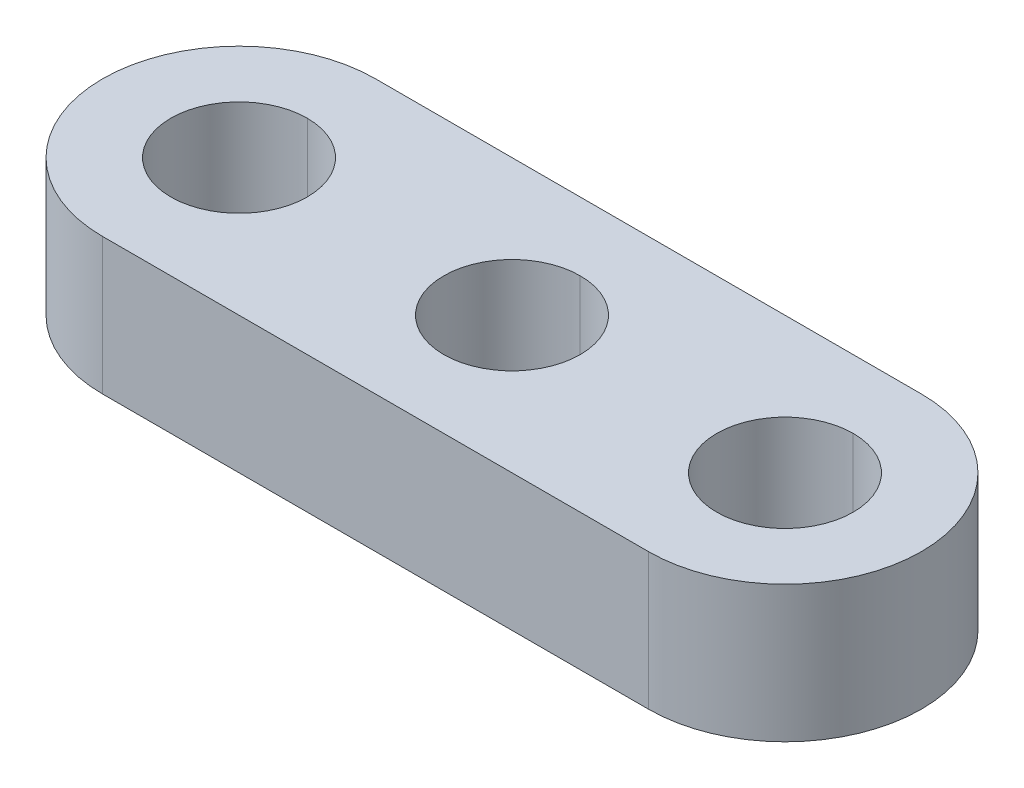
ISO-10303-21;
HEADER;
FILE_DESCRIPTION(('STEP AP214'),'2;1');
FILE_NAME('part.step','',(''),(''),'','','');
FILE_SCHEMA(('AUTOMOTIVE_DESIGN { 1 0 10303 214 1 1 1 1 }'));
ENDSEC;
DATA;
#1=APPLICATION_CONTEXT('core data for automotive mechanical design processes');
#2=APPLICATION_PROTOCOL_DEFINITION('international standard','automotive_design',2000,#1);
#3=PRODUCT_CONTEXT('',#1,'mechanical');
#4=PRODUCT('Part','Part','',(#3));
#5=PRODUCT_RELATED_PRODUCT_CATEGORY('part','',(#4));
#6=PRODUCT_DEFINITION_FORMATION('','',#4);
#7=PRODUCT_DEFINITION_CONTEXT('part definition',#1,'design');
#8=PRODUCT_DEFINITION('design','',#6,#7);
#9=PRODUCT_DEFINITION_SHAPE('','',#8);
#10=(LENGTH_UNIT() NAMED_UNIT(*) SI_UNIT(.MILLI.,.METRE.));
#11=(NAMED_UNIT(*) PLANE_ANGLE_UNIT() SI_UNIT($,.RADIAN.));
#12=(NAMED_UNIT(*) SI_UNIT($,.STERADIAN.) SOLID_ANGLE_UNIT());
#13=UNCERTAINTY_MEASURE_WITH_UNIT(LENGTH_MEASURE(1.E-05),#10,'distance_accuracy_value','');
#14=(GEOMETRIC_REPRESENTATION_CONTEXT(3) GLOBAL_UNCERTAINTY_ASSIGNED_CONTEXT((#13)) GLOBAL_UNIT_ASSIGNED_CONTEXT((#10,
#11,#12)) REPRESENTATION_CONTEXT('',''));
#15=CARTESIAN_POINT('',(0.,0.,0.));
#16=DIRECTION('',(0.,0.,1.));
#17=DIRECTION('',(1.,0.,0.));
#18=AXIS2_PLACEMENT_3D('',#15,#16,#17);
#19=CARTESIAN_POINT('',(8.,4.,0.));
#20=DIRECTION('',(0.,1.,0.));
#21=DIRECTION('',(0.,0.,1.));
#22=AXIS2_PLACEMENT_3D('',#19,#20,#21);
#23=CYLINDRICAL_SURFACE('',#22,2.);
#24=DIRECTION('',(0.,1.,0.));
#25=VECTOR('',#24,1.);
#26=CARTESIAN_POINT('',(8.,4.,-2.));
#27=LINE('',#26,#25);
#28=CARTESIAN_POINT('',(8.,0.,-2.));
#29=VERTEX_POINT('',#28);
#30=CARTESIAN_POINT('',(8.,4.,-2.));
#31=VERTEX_POINT('',#30);
#32=EDGE_CURVE('E172',#29,#31,#27,.T.);
#33=ORIENTED_EDGE('',*,*,#32,.F.);
#34=CARTESIAN_POINT('',(8.,0.,0.));
#35=DIRECTION('',(0.,1.,0.));
#36=DIRECTION('',(0.,0.,1.));
#37=AXIS2_PLACEMENT_3D('',#34,#35,#36);
#38=CIRCLE('',#37,2.);
#39=CARTESIAN_POINT('',(8.,0.,2.));
#40=VERTEX_POINT('',#39);
#41=EDGE_CURVE('E201',#40,#29,#38,.T.);
#42=ORIENTED_EDGE('',*,*,#41,.F.);
#43=DIRECTION('',(0.,1.,0.));
#44=VECTOR('',#43,1.);
#45=CARTESIAN_POINT('',(8.,4.,2.));
#46=LINE('',#45,#44);
#47=CARTESIAN_POINT('',(8.,4.,2.));
#48=VERTEX_POINT('',#47);
#49=EDGE_CURVE('E171',#40,#48,#46,.T.);
#50=ORIENTED_EDGE('',*,*,#49,.T.);
#51=CARTESIAN_POINT('',(8.,4.,0.));
#52=DIRECTION('',(0.,1.,0.));
#53=DIRECTION('',(0.,0.,1.));
#54=AXIS2_PLACEMENT_3D('',#51,#52,#53);
#55=CIRCLE('',#54,2.);
#56=EDGE_CURVE('E152',#48,#31,#55,.T.);
#57=ORIENTED_EDGE('',*,*,#56,.T.);
#58=EDGE_LOOP('',(#33,#42,#50,#57));
#59=FACE_BOUND('',#58,.T.);
#60=ADVANCED_FACE('F15',(#59),#23,.F.);
#61=CARTESIAN_POINT('',(0.,4.,0.));
#62=DIRECTION('',(0.,1.,0.));
#63=DIRECTION('',(0.,0.,1.));
#64=AXIS2_PLACEMENT_3D('',#61,#62,#63);
#65=CYLINDRICAL_SURFACE('',#64,2.);
#66=DIRECTION('',(0.,1.,0.));
#67=VECTOR('',#66,1.);
#68=CARTESIAN_POINT('',(0.,4.,-2.));
#69=LINE('',#68,#67);
#70=CARTESIAN_POINT('',(0.,0.,-2.));
#71=VERTEX_POINT('',#70);
#72=CARTESIAN_POINT('',(0.,4.,-2.));
#73=VERTEX_POINT('',#72);
#74=EDGE_CURVE('E200',#71,#73,#69,.T.);
#75=ORIENTED_EDGE('',*,*,#74,.F.);
#76=CARTESIAN_POINT('',(0.,0.,0.));
#77=DIRECTION('',(0.,1.,0.));
#78=DIRECTION('',(0.,0.,1.));
#79=AXIS2_PLACEMENT_3D('',#76,#77,#78);
#80=CIRCLE('',#79,2.);
#81=CARTESIAN_POINT('',(0.,0.,2.));
#82=VERTEX_POINT('',#81);
#83=EDGE_CURVE('E25',#82,#71,#80,.T.);
#84=ORIENTED_EDGE('',*,*,#83,.F.);
#85=DIRECTION('',(0.,1.,0.));
#86=VECTOR('',#85,1.);
#87=CARTESIAN_POINT('',(0.,4.,2.));
#88=LINE('',#87,#86);
#89=CARTESIAN_POINT('',(0.,4.,2.));
#90=VERTEX_POINT('',#89);
#91=EDGE_CURVE('E134',#82,#90,#88,.T.);
#92=ORIENTED_EDGE('',*,*,#91,.T.);
#93=CARTESIAN_POINT('',(0.,4.,0.));
#94=DIRECTION('',(0.,1.,0.));
#95=DIRECTION('',(0.,0.,1.));
#96=AXIS2_PLACEMENT_3D('',#93,#94,#95);
#97=CIRCLE('',#96,2.);
#98=EDGE_CURVE('E148',#90,#73,#97,.T.);
#99=ORIENTED_EDGE('',*,*,#98,.T.);
#100=EDGE_LOOP('',(#75,#84,#92,#99));
#101=FACE_BOUND('',#100,.T.);
#102=ADVANCED_FACE('F220',(#101),#65,.F.);
#103=CARTESIAN_POINT('',(-8.,4.,0.));
#104=DIRECTION('',(0.,1.,0.));
#105=DIRECTION('',(0.,0.,1.));
#106=AXIS2_PLACEMENT_3D('',#103,#104,#105);
#107=CYLINDRICAL_SURFACE('',#106,2.);
#108=DIRECTION('',(0.,1.,0.));
#109=VECTOR('',#108,1.);
#110=CARTESIAN_POINT('',(-8.,4.,-2.));
#111=LINE('',#110,#109);
#112=CARTESIAN_POINT('',(-8.,0.,-2.));
#113=VERTEX_POINT('',#112);
#114=CARTESIAN_POINT('',(-8.,4.,-2.));
#115=VERTEX_POINT('',#114);
#116=EDGE_CURVE('E120',#113,#115,#111,.T.);
#117=ORIENTED_EDGE('',*,*,#116,.F.);
#118=CARTESIAN_POINT('',(-8.,0.,0.));
#119=DIRECTION('',(0.,1.,0.));
#120=DIRECTION('',(0.,0.,1.));
#121=AXIS2_PLACEMENT_3D('',#118,#119,#120);
#122=CIRCLE('',#121,2.);
#123=CARTESIAN_POINT('',(-8.,0.,2.));
#124=VERTEX_POINT('',#123);
#125=EDGE_CURVE('E10',#124,#113,#122,.T.);
#126=ORIENTED_EDGE('',*,*,#125,.F.);
#127=DIRECTION('',(0.,1.,0.));
#128=VECTOR('',#127,1.);
#129=CARTESIAN_POINT('',(-8.,4.,2.));
#130=LINE('',#129,#128);
#131=CARTESIAN_POINT('',(-8.,4.,2.));
#132=VERTEX_POINT('',#131);
#133=EDGE_CURVE('E117',#124,#132,#130,.T.);
#134=ORIENTED_EDGE('',*,*,#133,.T.);
#135=CARTESIAN_POINT('',(-8.,4.,0.));
#136=DIRECTION('',(0.,1.,0.));
#137=DIRECTION('',(0.,0.,1.));
#138=AXIS2_PLACEMENT_3D('',#135,#136,#137);
#139=CIRCLE('',#138,2.);
#140=EDGE_CURVE('E151',#132,#115,#139,.T.);
#141=ORIENTED_EDGE('',*,*,#140,.T.);
#142=EDGE_LOOP('',(#117,#126,#134,#141));
#143=FACE_BOUND('',#142,.T.);
#144=ADVANCED_FACE('F116',(#143),#107,.F.);
#145=CARTESIAN_POINT('',(-8.,0.,0.));
#146=DIRECTION('',(0.,1.,0.));
#147=DIRECTION('',(1.,0.,0.));
#148=AXIS2_PLACEMENT_3D('',#145,#146,#147);
#149=PLANE('',#148);
#150=ORIENTED_EDGE('',*,*,#125,.T.);
#151=CARTESIAN_POINT('',(-8.,0.,0.));
#152=DIRECTION('',(0.,1.,0.));
#153=DIRECTION('',(0.,0.,1.));
#154=AXIS2_PLACEMENT_3D('',#151,#152,#153);
#155=CIRCLE('',#154,2.);
#156=EDGE_CURVE('E126',#113,#124,#155,.T.);
#157=ORIENTED_EDGE('',*,*,#156,.T.);
#158=EDGE_LOOP('',(#150,#157));
#159=FACE_BOUND('',#158,.T.);
#160=ORIENTED_EDGE('',*,*,#83,.T.);
#161=CARTESIAN_POINT('',(0.,0.,0.));
#162=DIRECTION('',(0.,1.,0.));
#163=DIRECTION('',(0.,0.,1.));
#164=AXIS2_PLACEMENT_3D('',#161,#162,#163);
#165=CIRCLE('',#164,2.);
#166=EDGE_CURVE('E209',#71,#82,#165,.T.);
#167=ORIENTED_EDGE('',*,*,#166,.T.);
#168=EDGE_LOOP('',(#160,#167));
#169=FACE_BOUND('',#168,.T.);
#170=ORIENTED_EDGE('',*,*,#41,.T.);
#171=CARTESIAN_POINT('',(8.,0.,0.));
#172=DIRECTION('',(0.,1.,0.));
#173=DIRECTION('',(0.,0.,1.));
#174=AXIS2_PLACEMENT_3D('',#171,#172,#173);
#175=CIRCLE('',#174,2.);
#176=EDGE_CURVE('E508',#29,#40,#175,.T.);
#177=ORIENTED_EDGE('',*,*,#176,.T.);
#178=EDGE_LOOP('',(#170,#177));
#179=FACE_BOUND('',#178,.T.);
#180=CARTESIAN_POINT('',(-8.,0.,0.));
#181=DIRECTION('',(0.,1.,0.));
#182=DIRECTION('',(0.,0.,1.));
#183=AXIS2_PLACEMENT_3D('',#180,#181,#182);
#184=CIRCLE('',#183,4.);
#185=CARTESIAN_POINT('',(-8.,0.,-4.));
#186=VERTEX_POINT('',#185);
#187=CARTESIAN_POINT('',(-8.,0.,4.));
#188=VERTEX_POINT('',#187);
#189=EDGE_CURVE('E18',#186,#188,#184,.T.);
#190=ORIENTED_EDGE('',*,*,#189,.F.);
#191=DIRECTION('',(-1.,0.,0.));
#192=VECTOR('',#191,1.);
#193=CARTESIAN_POINT('',(-8.,0.,-4.));
#194=LINE('',#193,#192);
#195=CARTESIAN_POINT('',(8.,0.,-4.));
#196=VERTEX_POINT('',#195);
#197=EDGE_CURVE('E175',#196,#186,#194,.T.);
#198=ORIENTED_EDGE('',*,*,#197,.F.);
#199=CARTESIAN_POINT('',(8.,0.,0.));
#200=DIRECTION('',(0.,1.,0.));
#201=DIRECTION('',(0.,0.,1.));
#202=AXIS2_PLACEMENT_3D('',#199,#200,#201);
#203=CIRCLE('',#202,4.);
#204=CARTESIAN_POINT('',(8.,0.,4.));
#205=VERTEX_POINT('',#204);
#206=EDGE_CURVE('E161',#205,#196,#203,.T.);
#207=ORIENTED_EDGE('',*,*,#206,.F.);
#208=DIRECTION('',(1.,0.,0.));
#209=VECTOR('',#208,1.);
#210=CARTESIAN_POINT('',(-8.,0.,4.));
#211=LINE('',#210,#209);
#212=EDGE_CURVE('E193',#188,#205,#211,.T.);
#213=ORIENTED_EDGE('',*,*,#212,.F.);
#214=EDGE_LOOP('',(#190,#198,#207,#213));
#215=FACE_BOUND('',#214,.T.);
#216=ADVANCED_FACE('F131',(#159,#169,#179,#215),#149,.F.);
#217=CARTESIAN_POINT('',(-8.,4.,0.));
#218=DIRECTION('',(0.,1.,0.));
#219=DIRECTION('',(1.,0.,0.));
#220=AXIS2_PLACEMENT_3D('',#217,#218,#219);
#221=PLANE('',#220);
#222=ORIENTED_EDGE('',*,*,#140,.F.);
#223=CARTESIAN_POINT('',(-8.,4.,0.));
#224=DIRECTION('',(0.,1.,0.));
#225=DIRECTION('',(0.,0.,1.));
#226=AXIS2_PLACEMENT_3D('',#223,#224,#225);
#227=CIRCLE('',#226,2.);
#228=EDGE_CURVE('E128',#115,#132,#227,.T.);
#229=ORIENTED_EDGE('',*,*,#228,.F.);
#230=EDGE_LOOP('',(#222,#229));
#231=FACE_BOUND('',#230,.T.);
#232=ORIENTED_EDGE('',*,*,#98,.F.);
#233=CARTESIAN_POINT('',(0.,4.,0.));
#234=DIRECTION('',(0.,1.,0.));
#235=DIRECTION('',(0.,0.,1.));
#236=AXIS2_PLACEMENT_3D('',#233,#234,#235);
#237=CIRCLE('',#236,2.);
#238=EDGE_CURVE('E143',#73,#90,#237,.T.);
#239=ORIENTED_EDGE('',*,*,#238,.F.);
#240=EDGE_LOOP('',(#232,#239));
#241=FACE_BOUND('',#240,.T.);
#242=ORIENTED_EDGE('',*,*,#56,.F.);
#243=CARTESIAN_POINT('',(8.,4.,0.));
#244=DIRECTION('',(0.,1.,0.));
#245=DIRECTION('',(0.,0.,1.));
#246=AXIS2_PLACEMENT_3D('',#243,#244,#245);
#247=CIRCLE('',#246,2.);
#248=EDGE_CURVE('E167',#31,#48,#247,.T.);
#249=ORIENTED_EDGE('',*,*,#248,.F.);
#250=EDGE_LOOP('',(#242,#249));
#251=FACE_BOUND('',#250,.T.);
#252=CARTESIAN_POINT('',(-8.,4.,0.));
#253=DIRECTION('',(0.,1.,0.));
#254=DIRECTION('',(0.,0.,1.));
#255=AXIS2_PLACEMENT_3D('',#252,#253,#254);
#256=CIRCLE('',#255,4.);
#257=CARTESIAN_POINT('',(-8.,4.,-4.));
#258=VERTEX_POINT('',#257);
#259=CARTESIAN_POINT('',(-8.,4.,4.));
#260=VERTEX_POINT('',#259);
#261=EDGE_CURVE('E153',#258,#260,#256,.T.);
#262=ORIENTED_EDGE('',*,*,#261,.T.);
#263=DIRECTION('',(1.,0.,0.));
#264=VECTOR('',#263,1.);
#265=CARTESIAN_POINT('',(-8.,4.,4.));
#266=LINE('',#265,#264);
#267=CARTESIAN_POINT('',(8.,4.,4.));
#268=VERTEX_POINT('',#267);
#269=EDGE_CURVE('E166',#260,#268,#266,.T.);
#270=ORIENTED_EDGE('',*,*,#269,.T.);
#271=CARTESIAN_POINT('',(8.,4.,0.));
#272=DIRECTION('',(0.,1.,0.));
#273=DIRECTION('',(0.,0.,1.));
#274=AXIS2_PLACEMENT_3D('',#271,#272,#273);
#275=CIRCLE('',#274,4.);
#276=CARTESIAN_POINT('',(8.,4.,-4.));
#277=VERTEX_POINT('',#276);
#278=EDGE_CURVE('E174',#268,#277,#275,.T.);
#279=ORIENTED_EDGE('',*,*,#278,.T.);
#280=DIRECTION('',(-1.,0.,0.));
#281=VECTOR('',#280,1.);
#282=CARTESIAN_POINT('',(-8.,4.,-4.));
#283=LINE('',#282,#281);
#284=EDGE_CURVE('E40',#277,#258,#283,.T.);
#285=ORIENTED_EDGE('',*,*,#284,.T.);
#286=EDGE_LOOP('',(#262,#270,#279,#285));
#287=FACE_BOUND('',#286,.T.);
#288=ADVANCED_FACE('F270',(#231,#241,#251,#287),#221,.T.);
#289=CARTESIAN_POINT('',(-8.,4.,-4.));
#290=DIRECTION('',(0.,0.,1.));
#291=DIRECTION('',(1.,0.,0.));
#292=AXIS2_PLACEMENT_3D('',#289,#290,#291);
#293=PLANE('',#292);
#294=ORIENTED_EDGE('',*,*,#197,.T.);
#295=DIRECTION('',(0.,-1.,0.));
#296=VECTOR('',#295,1.);
#297=CARTESIAN_POINT('',(-8.,4.,-4.));
#298=LINE('',#297,#296);
#299=EDGE_CURVE('E157',#258,#186,#298,.T.);
#300=ORIENTED_EDGE('',*,*,#299,.F.);
#301=ORIENTED_EDGE('',*,*,#284,.F.);
#302=DIRECTION('',(0.,-1.,0.));
#303=VECTOR('',#302,1.);
#304=CARTESIAN_POINT('',(8.,4.,-4.));
#305=LINE('',#304,#303);
#306=EDGE_CURVE('E165',#277,#196,#305,.T.);
#307=ORIENTED_EDGE('',*,*,#306,.T.);
#308=EDGE_LOOP('',(#294,#300,#301,#307));
#309=FACE_BOUND('',#308,.T.);
#310=ADVANCED_FACE('F275',(#309),#293,.F.);
#311=CARTESIAN_POINT('',(8.,4.,0.));
#312=DIRECTION('',(0.,-1.,0.));
#313=DIRECTION('',(0.,0.,-1.));
#314=AXIS2_PLACEMENT_3D('',#311,#312,#313);
#315=CYLINDRICAL_SURFACE('',#314,4.);
#316=ORIENTED_EDGE('',*,*,#206,.T.);
#317=ORIENTED_EDGE('',*,*,#306,.F.);
#318=ORIENTED_EDGE('',*,*,#278,.F.);
#319=DIRECTION('',(0.,-1.,0.));
#320=VECTOR('',#319,1.);
#321=CARTESIAN_POINT('',(8.,4.,4.));
#322=LINE('',#321,#320);
#323=EDGE_CURVE('E196',#268,#205,#322,.T.);
#324=ORIENTED_EDGE('',*,*,#323,.T.);
#325=EDGE_LOOP('',(#316,#317,#318,#324));
#326=FACE_BOUND('',#325,.T.);
#327=ADVANCED_FACE('F259',(#326),#315,.T.);
#328=CARTESIAN_POINT('',(-8.,4.,4.));
#329=DIRECTION('',(0.,0.,-1.));
#330=DIRECTION('',(0.,-1.,0.));
#331=AXIS2_PLACEMENT_3D('',#328,#329,#330);
#332=PLANE('',#331);
#333=ORIENTED_EDGE('',*,*,#212,.T.);
#334=ORIENTED_EDGE('',*,*,#323,.F.);
#335=ORIENTED_EDGE('',*,*,#269,.F.);
#336=DIRECTION('',(0.,-1.,0.));
#337=VECTOR('',#336,1.);
#338=CARTESIAN_POINT('',(-8.,4.,4.));
#339=LINE('',#338,#337);
#340=EDGE_CURVE('E158',#260,#188,#339,.T.);
#341=ORIENTED_EDGE('',*,*,#340,.T.);
#342=EDGE_LOOP('',(#333,#334,#335,#341));
#343=FACE_BOUND('',#342,.T.);
#344=ADVANCED_FACE('F254',(#343),#332,.F.);
#345=CARTESIAN_POINT('',(-8.,4.,0.));
#346=DIRECTION('',(0.,-1.,0.));
#347=DIRECTION('',(0.,0.,-1.));
#348=AXIS2_PLACEMENT_3D('',#345,#346,#347);
#349=CYLINDRICAL_SURFACE('',#348,4.);
#350=ORIENTED_EDGE('',*,*,#189,.T.);
#351=ORIENTED_EDGE('',*,*,#340,.F.);
#352=ORIENTED_EDGE('',*,*,#261,.F.);
#353=ORIENTED_EDGE('',*,*,#299,.T.);
#354=EDGE_LOOP('',(#350,#351,#352,#353));
#355=FACE_BOUND('',#354,.T.);
#356=ADVANCED_FACE('F243',(#355),#349,.T.);
#357=CARTESIAN_POINT('',(-8.,4.,0.));
#358=DIRECTION('',(0.,1.,0.));
#359=DIRECTION('',(0.,0.,1.));
#360=AXIS2_PLACEMENT_3D('',#357,#358,#359);
#361=CYLINDRICAL_SURFACE('',#360,2.);
#362=ORIENTED_EDGE('',*,*,#156,.F.);
#363=ORIENTED_EDGE('',*,*,#116,.T.);
#364=ORIENTED_EDGE('',*,*,#228,.T.);
#365=ORIENTED_EDGE('',*,*,#133,.F.);
#366=EDGE_LOOP('',(#362,#363,#364,#365));
#367=FACE_BOUND('',#366,.T.);
#368=ADVANCED_FACE('F125',(#367),#361,.F.);
#369=CARTESIAN_POINT('',(0.,4.,0.));
#370=DIRECTION('',(0.,1.,0.));
#371=DIRECTION('',(0.,0.,1.));
#372=AXIS2_PLACEMENT_3D('',#369,#370,#371);
#373=CYLINDRICAL_SURFACE('',#372,2.);
#374=ORIENTED_EDGE('',*,*,#166,.F.);
#375=ORIENTED_EDGE('',*,*,#74,.T.);
#376=ORIENTED_EDGE('',*,*,#238,.T.);
#377=ORIENTED_EDGE('',*,*,#91,.F.);
#378=EDGE_LOOP('',(#374,#375,#376,#377));
#379=FACE_BOUND('',#378,.T.);
#380=ADVANCED_FACE('F225',(#379),#373,.F.);
#381=CARTESIAN_POINT('',(8.,4.,0.));
#382=DIRECTION('',(0.,1.,0.));
#383=DIRECTION('',(0.,0.,1.));
#384=AXIS2_PLACEMENT_3D('',#381,#382,#383);
#385=CYLINDRICAL_SURFACE('',#384,2.);
#386=ORIENTED_EDGE('',*,*,#176,.F.);
#387=ORIENTED_EDGE('',*,*,#32,.T.);
#388=ORIENTED_EDGE('',*,*,#248,.T.);
#389=ORIENTED_EDGE('',*,*,#49,.F.);
#390=EDGE_LOOP('',(#386,#387,#388,#389));
#391=FACE_BOUND('',#390,.T.);
#392=ADVANCED_FACE('F309',(#391),#385,.F.);
#393=CLOSED_SHELL('',(#60,#102,#144,#216,#288,#310,#327,#344,#356,#368,#380,#392));
#394=MANIFOLD_SOLID_BREP('B1',#393);
#395=ADVANCED_BREP_SHAPE_REPRESENTATION('',(#18,#394),#14);
#396=SHAPE_DEFINITION_REPRESENTATION(#9,#395);
ENDSEC;
END-ISO-10303-21;
